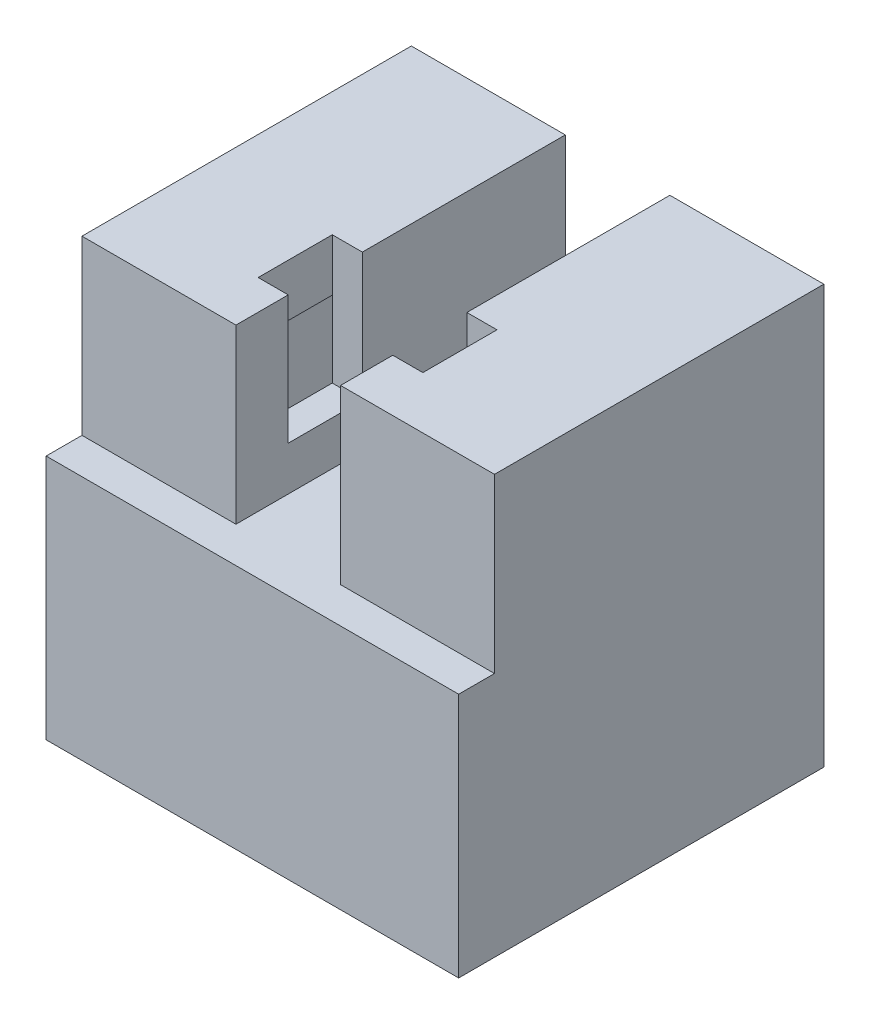
ISO-10303-21;
HEADER;
FILE_DESCRIPTION(('STEP AP214'),'2;1');
FILE_NAME('part.step','',(''),(''),'','','');
FILE_SCHEMA(('AUTOMOTIVE_DESIGN { 1 0 10303 214 1 1 1 1 }'));
ENDSEC;
DATA;
#1=APPLICATION_CONTEXT('core data for automotive mechanical design processes');
#2=APPLICATION_PROTOCOL_DEFINITION('international standard','automotive_design',2000,#1);
#3=PRODUCT_CONTEXT('',#1,'mechanical');
#4=PRODUCT('Part','Part','',(#3));
#5=PRODUCT_RELATED_PRODUCT_CATEGORY('part','',(#4));
#6=PRODUCT_DEFINITION_FORMATION('','',#4);
#7=PRODUCT_DEFINITION_CONTEXT('part definition',#1,'design');
#8=PRODUCT_DEFINITION('design','',#6,#7);
#9=PRODUCT_DEFINITION_SHAPE('','',#8);
#10=(LENGTH_UNIT() NAMED_UNIT(*) SI_UNIT(.MILLI.,.METRE.));
#11=(NAMED_UNIT(*) PLANE_ANGLE_UNIT() SI_UNIT($,.RADIAN.));
#12=(NAMED_UNIT(*) SI_UNIT($,.STERADIAN.) SOLID_ANGLE_UNIT());
#13=UNCERTAINTY_MEASURE_WITH_UNIT(LENGTH_MEASURE(1.E-05),#10,'distance_accuracy_value','');
#14=(GEOMETRIC_REPRESENTATION_CONTEXT(3) GLOBAL_UNCERTAINTY_ASSIGNED_CONTEXT((#13)) GLOBAL_UNIT_ASSIGNED_CONTEXT((#10,
#11,#12)) REPRESENTATION_CONTEXT('',''));
#15=CARTESIAN_POINT('',(0.,0.,0.));
#16=DIRECTION('',(0.,0.,1.));
#17=DIRECTION('',(1.,0.,0.));
#18=AXIS2_PLACEMENT_3D('',#15,#16,#17);
#19=CARTESIAN_POINT('',(-9.35,25.4,10.));
#20=DIRECTION('',(0.,0.,-1.));
#21=DIRECTION('',(-1.,0.,0.));
#22=AXIS2_PLACEMENT_3D('',#19,#20,#21);
#23=PLANE('',#22);
#24=DIRECTION('',(0.,-1.,0.));
#25=VECTOR('',#24,1.);
#26=CARTESIAN_POINT('',(-12.525,25.4,10.));
#27=LINE('',#26,#25);
#28=CARTESIAN_POINT('',(-12.525,25.4,10.));
#29=VERTEX_POINT('',#28);
#30=CARTESIAN_POINT('',(-12.525,14.925,10.));
#31=VERTEX_POINT('',#30);
#32=EDGE_CURVE('E409',#29,#31,#27,.T.);
#33=ORIENTED_EDGE('',*,*,#32,.T.);
#34=DIRECTION('',(1.,0.,0.));
#35=VECTOR('',#34,1.);
#36=CARTESIAN_POINT('',(-27.6076473140493,14.925,10.));
#37=LINE('',#36,#35);
#38=CARTESIAN_POINT('',(-3.175,14.925,10.));
#39=VERTEX_POINT('',#38);
#40=EDGE_CURVE('E44',#31,#39,#37,.T.);
#41=ORIENTED_EDGE('',*,*,#40,.T.);
#42=DIRECTION('',(0.,-1.,0.));
#43=VECTOR('',#42,1.);
#44=CARTESIAN_POINT('',(-3.175,0.,10.));
#45=LINE('',#44,#43);
#46=CARTESIAN_POINT('',(-3.175,25.4,10.));
#47=VERTEX_POINT('',#46);
#48=EDGE_CURVE('E432',#47,#39,#45,.T.);
#49=ORIENTED_EDGE('',*,*,#48,.F.);
#50=DIRECTION('',(1.,0.,0.));
#51=VECTOR('',#50,1.);
#52=CARTESIAN_POINT('',(-9.35,25.4,10.));
#53=LINE('',#52,#51);
#54=EDGE_CURVE('E459',#29,#47,#53,.T.);
#55=ORIENTED_EDGE('',*,*,#54,.F.);
#56=EDGE_LOOP('',(#33,#41,#49,#55));
#57=FACE_BOUND('',#56,.T.);
#58=ADVANCED_FACE('F33',(#57),#23,.F.);
#59=CARTESIAN_POINT('',(0.,0.,6.825));
#60=DIRECTION('',(0.,0.,-1.));
#61=DIRECTION('',(-1.,0.,0.));
#62=AXIS2_PLACEMENT_3D('',#59,#60,#61);
#63=PLANE('',#62);
#64=DIRECTION('',(1.,0.,0.));
#65=VECTOR('',#64,1.);
#66=CARTESIAN_POINT('',(0.,10.125,6.825));
#67=LINE('',#66,#65);
#68=CARTESIAN_POINT('',(-9.35,10.125,6.825));
#69=VERTEX_POINT('',#68);
#70=CARTESIAN_POINT('',(-5.,10.125,6.825));
#71=VERTEX_POINT('',#70);
#72=EDGE_CURVE('E42',#69,#71,#67,.T.);
#73=ORIENTED_EDGE('',*,*,#72,.F.);
#74=DIRECTION('',(0.,1.,0.));
#75=VECTOR('',#74,1.);
#76=CARTESIAN_POINT('',(-9.35,0.,6.825));
#77=LINE('',#76,#75);
#78=CARTESIAN_POINT('',(-9.35,22.225,6.825));
#79=VERTEX_POINT('',#78);
#80=EDGE_CURVE('E371',#69,#79,#77,.T.);
#81=ORIENTED_EDGE('',*,*,#80,.T.);
#82=DIRECTION('',(1.,0.,0.));
#83=VECTOR('',#82,1.);
#84=CARTESIAN_POINT('',(0.,22.225,6.825));
#85=LINE('',#84,#83);
#86=CARTESIAN_POINT('',(-5.,22.225,6.825));
#87=VERTEX_POINT('',#86);
#88=EDGE_CURVE('E373',#79,#87,#85,.T.);
#89=ORIENTED_EDGE('',*,*,#88,.T.);
#90=DIRECTION('',(0.,-1.,0.));
#91=VECTOR('',#90,1.);
#92=CARTESIAN_POINT('',(-5.,25.4,6.825));
#93=LINE('',#92,#91);
#94=CARTESIAN_POINT('',(-5.,25.4,6.825));
#95=VERTEX_POINT('',#94);
#96=EDGE_CURVE('E281',#95,#87,#93,.T.);
#97=ORIENTED_EDGE('',*,*,#96,.F.);
#98=DIRECTION('',(-1.,0.,0.));
#99=VECTOR('',#98,1.);
#100=CARTESIAN_POINT('',(-3.175,25.4,6.825));
#101=LINE('',#100,#99);
#102=CARTESIAN_POINT('',(-3.175,25.4,6.825));
#103=VERTEX_POINT('',#102);
#104=EDGE_CURVE('E51',#103,#95,#101,.T.);
#105=ORIENTED_EDGE('',*,*,#104,.F.);
#106=DIRECTION('',(0.,1.,0.));
#107=VECTOR('',#106,1.);
#108=CARTESIAN_POINT('',(-3.175,25.4,6.825));
#109=LINE('',#108,#107);
#110=CARTESIAN_POINT('',(-3.175,17.6,6.825));
#111=VERTEX_POINT('',#110);
#112=EDGE_CURVE('E266',#111,#103,#109,.T.);
#113=ORIENTED_EDGE('',*,*,#112,.F.);
#114=DIRECTION('',(1.,0.,0.));
#115=VECTOR('',#114,1.);
#116=CARTESIAN_POINT('',(-3.175,17.6,6.825));
#117=LINE('',#116,#115);
#118=CARTESIAN_POINT('',(-5.,17.6,6.825));
#119=VERTEX_POINT('',#118);
#120=EDGE_CURVE('E264',#119,#111,#117,.T.);
#121=ORIENTED_EDGE('',*,*,#120,.F.);
#122=DIRECTION('',(0.,1.,0.));
#123=VECTOR('',#122,1.);
#124=CARTESIAN_POINT('',(-5.,0.,6.825));
#125=LINE('',#124,#123);
#126=EDGE_CURVE('E359',#71,#119,#125,.T.);
#127=ORIENTED_EDGE('',*,*,#126,.F.);
#128=EDGE_LOOP('',(#73,#81,#89,#97,#105,#113,#121,#127));
#129=FACE_BOUND('',#128,.T.);
#130=ADVANCED_FACE('F518',(#129),#63,.T.);
#131=DIRECTION('',(0.,-1.,0.));
#132=VECTOR('',#131,1.);
#133=CARTESIAN_POINT('',(3.175,0.,10.));
#134=LINE('',#133,#132);
#135=CARTESIAN_POINT('',(3.175,25.4,10.));
#136=VERTEX_POINT('',#135);
#137=CARTESIAN_POINT('',(3.175,14.925,10.));
#138=VERTEX_POINT('',#137);
#139=EDGE_CURVE('E435',#136,#138,#134,.T.);
#140=ORIENTED_EDGE('',*,*,#139,.T.);
#141=CARTESIAN_POINT('',(12.525,14.925,10.));
#142=VERTEX_POINT('',#141);
#143=EDGE_CURVE('E11',#138,#142,#37,.T.);
#144=ORIENTED_EDGE('',*,*,#143,.T.);
#145=DIRECTION('',(0.,1.,0.));
#146=VECTOR('',#145,1.);
#147=CARTESIAN_POINT('',(12.525,25.4,10.));
#148=LINE('',#147,#146);
#149=CARTESIAN_POINT('',(12.525,25.4,10.));
#150=VERTEX_POINT('',#149);
#151=EDGE_CURVE('E421',#142,#150,#148,.T.);
#152=ORIENTED_EDGE('',*,*,#151,.T.);
#153=EDGE_CURVE('E463',#136,#150,#53,.T.);
#154=ORIENTED_EDGE('',*,*,#153,.F.);
#155=EDGE_LOOP('',(#140,#144,#152,#154));
#156=FACE_BOUND('',#155,.T.);
#157=ADVANCED_FACE('F35',(#156),#23,.F.);
#158=CARTESIAN_POINT('',(-9.35,25.4,-10.));
#159=DIRECTION('',(0.,0.,1.));
#160=DIRECTION('',(1.,0.,0.));
#161=AXIS2_PLACEMENT_3D('',#158,#159,#160);
#162=PLANE('',#161);
#163=DIRECTION('',(-1.,0.,0.));
#164=VECTOR('',#163,1.);
#165=CARTESIAN_POINT('',(-9.35,0.,-10.));
#166=LINE('',#165,#164);
#167=CARTESIAN_POINT('',(12.525,0.,-10.));
#168=VERTEX_POINT('',#167);
#169=CARTESIAN_POINT('',(11.,0.,-10.));
#170=VERTEX_POINT('',#169);
#171=EDGE_CURVE('E466',#168,#170,#166,.T.);
#172=ORIENTED_EDGE('',*,*,#171,.T.);
#173=DIRECTION('',(0.,-1.,0.));
#174=VECTOR('',#173,1.);
#175=CARTESIAN_POINT('',(11.,10.125,-10.));
#176=LINE('',#175,#174);
#177=CARTESIAN_POINT('',(11.,10.125,-10.));
#178=VERTEX_POINT('',#177);
#179=EDGE_CURVE('E322',#178,#170,#176,.T.);
#180=ORIENTED_EDGE('',*,*,#179,.F.);
#181=DIRECTION('',(1.,0.,0.));
#182=VECTOR('',#181,1.);
#183=CARTESIAN_POINT('',(11.,10.125,-10.));
#184=LINE('',#183,#182);
#185=CARTESIAN_POINT('',(9.35,10.125,-10.));
#186=VERTEX_POINT('',#185);
#187=EDGE_CURVE('E341',#186,#178,#184,.T.);
#188=ORIENTED_EDGE('',*,*,#187,.F.);
#189=DIRECTION('',(0.,-1.,0.));
#190=VECTOR('',#189,1.);
#191=CARTESIAN_POINT('',(9.35,0.,-10.));
#192=LINE('',#191,#190);
#193=CARTESIAN_POINT('',(9.35,22.225,-10.));
#194=VERTEX_POINT('',#193);
#195=EDGE_CURVE('E388',#194,#186,#192,.T.);
#196=ORIENTED_EDGE('',*,*,#195,.F.);
#197=DIRECTION('',(-1.,0.,0.));
#198=VECTOR('',#197,1.);
#199=CARTESIAN_POINT('',(0.,22.225,-10.));
#200=LINE('',#199,#198);
#201=CARTESIAN_POINT('',(5.,22.225,-10.));
#202=VERTEX_POINT('',#201);
#203=EDGE_CURVE('E385',#194,#202,#200,.T.);
#204=ORIENTED_EDGE('',*,*,#203,.T.);
#205=DIRECTION('',(0.,-1.,0.));
#206=VECTOR('',#205,1.);
#207=CARTESIAN_POINT('',(5.,0.,-10.));
#208=LINE('',#207,#206);
#209=CARTESIAN_POINT('',(5.,10.125,-10.));
#210=VERTEX_POINT('',#209);
#211=EDGE_CURVE('E382',#202,#210,#208,.T.);
#212=ORIENTED_EDGE('',*,*,#211,.T.);
#213=DIRECTION('',(-1.,0.,0.));
#214=VECTOR('',#213,1.);
#215=CARTESIAN_POINT('',(0.,10.125,-10.));
#216=LINE('',#215,#214);
#217=CARTESIAN_POINT('',(-5.,10.125,-10.));
#218=VERTEX_POINT('',#217);
#219=EDGE_CURVE('E379',#210,#218,#216,.T.);
#220=ORIENTED_EDGE('',*,*,#219,.T.);
#221=DIRECTION('',(0.,1.,0.));
#222=VECTOR('',#221,1.);
#223=CARTESIAN_POINT('',(-5.,0.,-10.));
#224=LINE('',#223,#222);
#225=CARTESIAN_POINT('',(-5.,22.225,-10.));
#226=VERTEX_POINT('',#225);
#227=EDGE_CURVE('E358',#218,#226,#224,.T.);
#228=ORIENTED_EDGE('',*,*,#227,.T.);
#229=DIRECTION('',(1.,0.,0.));
#230=VECTOR('',#229,1.);
#231=CARTESIAN_POINT('',(0.,22.225,-10.));
#232=LINE('',#231,#230);
#233=CARTESIAN_POINT('',(-9.35,22.225,-10.));
#234=VERTEX_POINT('',#233);
#235=EDGE_CURVE('E363',#234,#226,#232,.T.);
#236=ORIENTED_EDGE('',*,*,#235,.F.);
#237=DIRECTION('',(0.,1.,0.));
#238=VECTOR('',#237,1.);
#239=CARTESIAN_POINT('',(-9.35,0.,-10.));
#240=LINE('',#239,#238);
#241=CARTESIAN_POINT('',(-9.35,10.125,-10.));
#242=VERTEX_POINT('',#241);
#243=EDGE_CURVE('E391',#242,#234,#240,.T.);
#244=ORIENTED_EDGE('',*,*,#243,.F.);
#245=CARTESIAN_POINT('',(-11.,10.125,-10.));
#246=VERTEX_POINT('',#245);
#247=EDGE_CURVE('E327',#246,#242,#184,.T.);
#248=ORIENTED_EDGE('',*,*,#247,.F.);
#249=DIRECTION('',(0.,1.,0.));
#250=VECTOR('',#249,1.);
#251=CARTESIAN_POINT('',(-11.,10.125,-10.));
#252=LINE('',#251,#250);
#253=CARTESIAN_POINT('',(-11.,0.,-10.));
#254=VERTEX_POINT('',#253);
#255=EDGE_CURVE('E338',#254,#246,#252,.T.);
#256=ORIENTED_EDGE('',*,*,#255,.F.);
#257=CARTESIAN_POINT('',(-12.525,0.,-10.));
#258=VERTEX_POINT('',#257);
#259=EDGE_CURVE('E449',#254,#258,#166,.T.);
#260=ORIENTED_EDGE('',*,*,#259,.T.);
#261=DIRECTION('',(0.,1.,0.));
#262=VECTOR('',#261,1.);
#263=CARTESIAN_POINT('',(-12.525,25.4,-10.));
#264=LINE('',#263,#262);
#265=CARTESIAN_POINT('',(-12.525,25.4,-10.));
#266=VERTEX_POINT('',#265);
#267=EDGE_CURVE('E397',#258,#266,#264,.T.);
#268=ORIENTED_EDGE('',*,*,#267,.T.);
#269=DIRECTION('',(-1.,0.,0.));
#270=VECTOR('',#269,1.);
#271=CARTESIAN_POINT('',(-9.35,25.4,-10.));
#272=LINE('',#271,#270);
#273=CARTESIAN_POINT('',(-3.175,25.4,-10.));
#274=VERTEX_POINT('',#273);
#275=EDGE_CURVE('E462',#274,#266,#272,.T.);
#276=ORIENTED_EDGE('',*,*,#275,.F.);
#277=DIRECTION('',(0.,-1.,0.));
#278=VECTOR('',#277,1.);
#279=CARTESIAN_POINT('',(-3.175,0.,-10.));
#280=LINE('',#279,#278);
#281=CARTESIAN_POINT('',(-3.175,14.925,-10.));
#282=VERTEX_POINT('',#281);
#283=EDGE_CURVE('E423',#274,#282,#280,.T.);
#284=ORIENTED_EDGE('',*,*,#283,.T.);
#285=DIRECTION('',(-1.,0.,0.));
#286=VECTOR('',#285,1.);
#287=CARTESIAN_POINT('',(0.,14.925,-10.));
#288=LINE('',#287,#286);
#289=CARTESIAN_POINT('',(3.175,14.925,-10.));
#290=VERTEX_POINT('',#289);
#291=EDGE_CURVE('E436',#290,#282,#288,.T.);
#292=ORIENTED_EDGE('',*,*,#291,.F.);
#293=DIRECTION('',(0.,-1.,0.));
#294=VECTOR('',#293,1.);
#295=CARTESIAN_POINT('',(3.175,0.,-10.));
#296=LINE('',#295,#294);
#297=CARTESIAN_POINT('',(3.175,25.4,-10.));
#298=VERTEX_POINT('',#297);
#299=EDGE_CURVE('E442',#298,#290,#296,.T.);
#300=ORIENTED_EDGE('',*,*,#299,.F.);
#301=CARTESIAN_POINT('',(12.525,25.4,-10.));
#302=VERTEX_POINT('',#301);
#303=EDGE_CURVE('E464',#302,#298,#272,.T.);
#304=ORIENTED_EDGE('',*,*,#303,.F.);
#305=DIRECTION('',(0.,-1.,0.));
#306=VECTOR('',#305,1.);
#307=CARTESIAN_POINT('',(12.525,25.4,-10.));
#308=LINE('',#307,#306);
#309=EDGE_CURVE('E412',#302,#168,#308,.T.);
#310=ORIENTED_EDGE('',*,*,#309,.T.);
#311=EDGE_LOOP('',(#172,#180,#188,#196,#204,#212,#220,#228,#236,#244,#248,#256,#260,#268,#276,
#284,#292,#300,#304,#310));
#312=FACE_BOUND('',#311,.T.);
#313=ADVANCED_FACE('F473',(#312),#162,.F.);
#314=CARTESIAN_POINT('',(0.,25.4,0.));
#315=DIRECTION('',(0.,1.,0.));
#316=DIRECTION('',(0.,0.,1.));
#317=AXIS2_PLACEMENT_3D('',#314,#315,#316);
#318=PLANE('',#317);
#319=DIRECTION('',(1.,0.,0.));
#320=VECTOR('',#319,1.);
#321=CARTESIAN_POINT('',(-3.175,25.4,2.325));
#322=LINE('',#321,#320);
#323=CARTESIAN_POINT('',(-5.,25.4,2.325));
#324=VERTEX_POINT('',#323);
#325=CARTESIAN_POINT('',(-3.175,25.4,2.325));
#326=VERTEX_POINT('',#325);
#327=EDGE_CURVE('E296',#324,#326,#322,.T.);
#328=ORIENTED_EDGE('',*,*,#327,.T.);
#329=DIRECTION('',(0.,0.,-1.));
#330=VECTOR('',#329,1.);
#331=CARTESIAN_POINT('',(-3.175,25.4,10.));
#332=LINE('',#331,#330);
#333=EDGE_CURVE('E439',#326,#274,#332,.T.);
#334=ORIENTED_EDGE('',*,*,#333,.T.);
#335=ORIENTED_EDGE('',*,*,#275,.T.);
#336=DIRECTION('',(0.,0.,-1.));
#337=VECTOR('',#336,1.);
#338=CARTESIAN_POINT('',(-12.525,25.4,35.5976683508479));
#339=LINE('',#338,#337);
#340=EDGE_CURVE('E413',#29,#266,#339,.T.);
#341=ORIENTED_EDGE('',*,*,#340,.F.);
#342=ORIENTED_EDGE('',*,*,#54,.T.);
#343=EDGE_CURVE('E456',#47,#103,#332,.T.);
#344=ORIENTED_EDGE('',*,*,#343,.T.);
#345=ORIENTED_EDGE('',*,*,#104,.T.);
#346=DIRECTION('',(0.,0.,-1.));
#347=VECTOR('',#346,1.);
#348=CARTESIAN_POINT('',(-5.,25.4,14.8356569643195));
#349=LINE('',#348,#347);
#350=EDGE_CURVE('E283',#95,#324,#349,.T.);
#351=ORIENTED_EDGE('',*,*,#350,.T.);
#352=EDGE_LOOP('',(#328,#334,#335,#341,#342,#344,#345,#351));
#353=FACE_BOUND('',#352,.T.);
#354=ADVANCED_FACE('F487',(#353),#318,.T.);
#355=DIRECTION('',(1.,0.,0.));
#356=VECTOR('',#355,1.);
#357=CARTESIAN_POINT('',(5.,25.4,2.325));
#358=LINE('',#357,#356);
#359=CARTESIAN_POINT('',(3.175,25.4,2.325));
#360=VERTEX_POINT('',#359);
#361=CARTESIAN_POINT('',(5.,25.4,2.325));
#362=VERTEX_POINT('',#361);
#363=EDGE_CURVE('E248',#360,#362,#358,.T.);
#364=ORIENTED_EDGE('',*,*,#363,.T.);
#365=DIRECTION('',(0.,0.,-1.));
#366=VECTOR('',#365,1.);
#367=CARTESIAN_POINT('',(5.,25.4,14.8356569643195));
#368=LINE('',#367,#366);
#369=CARTESIAN_POINT('',(5.,25.4,6.825));
#370=VERTEX_POINT('',#369);
#371=EDGE_CURVE('E275',#370,#362,#368,.T.);
#372=ORIENTED_EDGE('',*,*,#371,.F.);
#373=DIRECTION('',(-1.,0.,0.));
#374=VECTOR('',#373,1.);
#375=CARTESIAN_POINT('',(5.,25.4,6.825));
#376=LINE('',#375,#374);
#377=CARTESIAN_POINT('',(3.175,25.4,6.825));
#378=VERTEX_POINT('',#377);
#379=EDGE_CURVE('E533',#370,#378,#376,.T.);
#380=ORIENTED_EDGE('',*,*,#379,.T.);
#381=DIRECTION('',(0.,0.,-1.));
#382=VECTOR('',#381,1.);
#383=CARTESIAN_POINT('',(3.175,25.4,10.));
#384=LINE('',#383,#382);
#385=EDGE_CURVE('E452',#136,#378,#384,.T.);
#386=ORIENTED_EDGE('',*,*,#385,.F.);
#387=ORIENTED_EDGE('',*,*,#153,.T.);
#388=DIRECTION('',(0.,0.,-1.));
#389=VECTOR('',#388,1.);
#390=CARTESIAN_POINT('',(12.525,25.4,35.5976683508479));
#391=LINE('',#390,#389);
#392=EDGE_CURVE('E427',#150,#302,#391,.T.);
#393=ORIENTED_EDGE('',*,*,#392,.T.);
#394=ORIENTED_EDGE('',*,*,#303,.T.);
#395=EDGE_CURVE('E455',#360,#298,#384,.T.);
#396=ORIENTED_EDGE('',*,*,#395,.F.);
#397=EDGE_LOOP('',(#364,#372,#380,#386,#387,#393,#394,#396));
#398=FACE_BOUND('',#397,.T.);
#399=ADVANCED_FACE('F504',(#398),#318,.T.);
#400=CARTESIAN_POINT('',(0.,0.,0.));
#401=DIRECTION('',(0.,1.,0.));
#402=DIRECTION('',(0.,0.,1.));
#403=AXIS2_PLACEMENT_3D('',#400,#401,#402);
#404=PLANE('',#403);
#405=DIRECTION('',(-1.,0.,0.));
#406=VECTOR('',#405,1.);
#407=CARTESIAN_POINT('',(11.,0.,9.));
#408=LINE('',#407,#406);
#409=CARTESIAN_POINT('',(11.,0.,9.));
#410=VERTEX_POINT('',#409);
#411=CARTESIAN_POINT('',(-11.,0.,9.));
#412=VERTEX_POINT('',#411);
#413=EDGE_CURVE('E326',#410,#412,#408,.T.);
#414=ORIENTED_EDGE('',*,*,#413,.F.);
#415=DIRECTION('',(0.,0.,-1.));
#416=VECTOR('',#415,1.);
#417=CARTESIAN_POINT('',(11.,0.,9.));
#418=LINE('',#417,#416);
#419=EDGE_CURVE('E336',#410,#170,#418,.T.);
#420=ORIENTED_EDGE('',*,*,#419,.T.);
#421=ORIENTED_EDGE('',*,*,#171,.F.);
#422=DIRECTION('',(0.,0.,-1.));
#423=VECTOR('',#422,1.);
#424=CARTESIAN_POINT('',(12.525,0.,35.5976683508479));
#425=LINE('',#424,#423);
#426=CARTESIAN_POINT('',(12.525,0.,12.175));
#427=VERTEX_POINT('',#426);
#428=EDGE_CURVE('E424',#427,#168,#425,.T.);
#429=ORIENTED_EDGE('',*,*,#428,.F.);
#430=DIRECTION('',(1.,0.,0.));
#431=VECTOR('',#430,1.);
#432=CARTESIAN_POINT('',(-27.6076473140494,0.,12.175));
#433=LINE('',#432,#431);
#434=CARTESIAN_POINT('',(-12.525,0.,12.175));
#435=VERTEX_POINT('',#434);
#436=EDGE_CURVE('E318',#435,#427,#433,.T.);
#437=ORIENTED_EDGE('',*,*,#436,.F.);
#438=DIRECTION('',(0.,0.,-1.));
#439=VECTOR('',#438,1.);
#440=CARTESIAN_POINT('',(-12.525,0.,35.5976683508479));
#441=LINE('',#440,#439);
#442=EDGE_CURVE('E416',#435,#258,#441,.T.);
#443=ORIENTED_EDGE('',*,*,#442,.T.);
#444=ORIENTED_EDGE('',*,*,#259,.F.);
#445=DIRECTION('',(0.,0.,-1.));
#446=VECTOR('',#445,1.);
#447=CARTESIAN_POINT('',(-11.,0.,9.));
#448=LINE('',#447,#446);
#449=EDGE_CURVE('E349',#412,#254,#448,.T.);
#450=ORIENTED_EDGE('',*,*,#449,.F.);
#451=EDGE_LOOP('',(#414,#420,#421,#429,#437,#443,#444,#450));
#452=FACE_BOUND('',#451,.T.);
#453=ADVANCED_FACE('F481',(#452),#404,.F.);
#454=CARTESIAN_POINT('',(-3.175,0.,10.));
#455=DIRECTION('',(1.,0.,0.));
#456=DIRECTION('',(0.,1.,0.));
#457=AXIS2_PLACEMENT_3D('',#454,#455,#456);
#458=PLANE('',#457);
#459=DIRECTION('',(0.,-1.,0.));
#460=VECTOR('',#459,1.);
#461=CARTESIAN_POINT('',(-3.175,25.4,2.325));
#462=LINE('',#461,#460);
#463=CARTESIAN_POINT('',(-3.175,17.6,2.325));
#464=VERTEX_POINT('',#463);
#465=EDGE_CURVE('E286',#326,#464,#462,.T.);
#466=ORIENTED_EDGE('',*,*,#465,.T.);
#467=DIRECTION('',(0.,0.,-1.));
#468=VECTOR('',#467,1.);
#469=CARTESIAN_POINT('',(-3.175,17.6,14.8356569643195));
#470=LINE('',#469,#468);
#471=EDGE_CURVE('E299',#111,#464,#470,.T.);
#472=ORIENTED_EDGE('',*,*,#471,.F.);
#473=ORIENTED_EDGE('',*,*,#112,.T.);
#474=ORIENTED_EDGE('',*,*,#343,.F.);
#475=ORIENTED_EDGE('',*,*,#48,.T.);
#476=DIRECTION('',(0.,0.,-1.));
#477=VECTOR('',#476,1.);
#478=CARTESIAN_POINT('',(-3.175,14.925,10.));
#479=LINE('',#478,#477);
#480=EDGE_CURVE('E447',#39,#282,#479,.T.);
#481=ORIENTED_EDGE('',*,*,#480,.T.);
#482=ORIENTED_EDGE('',*,*,#283,.F.);
#483=ORIENTED_EDGE('',*,*,#333,.F.);
#484=EDGE_LOOP('',(#466,#472,#473,#474,#475,#481,#482,#483));
#485=FACE_BOUND('',#484,.T.);
#486=ADVANCED_FACE('F493',(#485),#458,.T.);
#487=CARTESIAN_POINT('',(0.,14.925,10.));
#488=DIRECTION('',(0.,-1.,0.));
#489=DIRECTION('',(0.,0.,-1.));
#490=AXIS2_PLACEMENT_3D('',#487,#488,#489);
#491=PLANE('',#490);
#492=ORIENTED_EDGE('',*,*,#291,.T.);
#493=ORIENTED_EDGE('',*,*,#480,.F.);
#494=ORIENTED_EDGE('',*,*,#40,.F.);
#495=DIRECTION('',(0.,0.,1.));
#496=VECTOR('',#495,1.);
#497=CARTESIAN_POINT('',(-12.525,14.925,10.));
#498=LINE('',#497,#496);
#499=CARTESIAN_POINT('',(-12.525,14.925,12.175));
#500=VERTEX_POINT('',#499);
#501=EDGE_CURVE('E309',#31,#500,#498,.T.);
#502=ORIENTED_EDGE('',*,*,#501,.T.);
#503=DIRECTION('',(1.,0.,0.));
#504=VECTOR('',#503,1.);
#505=CARTESIAN_POINT('',(-27.6076473140493,14.925,12.175));
#506=LINE('',#505,#504);
#507=CARTESIAN_POINT('',(12.525,14.925,12.175));
#508=VERTEX_POINT('',#507);
#509=EDGE_CURVE('E314',#500,#508,#506,.T.);
#510=ORIENTED_EDGE('',*,*,#509,.T.);
#511=DIRECTION('',(0.,0.,1.));
#512=VECTOR('',#511,1.);
#513=CARTESIAN_POINT('',(12.525,14.925,10.));
#514=LINE('',#513,#512);
#515=EDGE_CURVE('E280',#142,#508,#514,.T.);
#516=ORIENTED_EDGE('',*,*,#515,.F.);
#517=ORIENTED_EDGE('',*,*,#143,.F.);
#518=DIRECTION('',(0.,0.,-1.));
#519=VECTOR('',#518,1.);
#520=CARTESIAN_POINT('',(3.175,14.925,10.));
#521=LINE('',#520,#519);
#522=EDGE_CURVE('E450',#138,#290,#521,.T.);
#523=ORIENTED_EDGE('',*,*,#522,.T.);
#524=EDGE_LOOP('',(#492,#493,#494,#502,#510,#516,#517,#523));
#525=FACE_BOUND('',#524,.T.);
#526=ADVANCED_FACE('F498',(#525),#491,.F.);
#527=CARTESIAN_POINT('',(3.175,0.,10.));
#528=DIRECTION('',(1.,0.,0.));
#529=DIRECTION('',(0.,1.,0.));
#530=AXIS2_PLACEMENT_3D('',#527,#528,#529);
#531=PLANE('',#530);
#532=DIRECTION('',(0.,0.,-1.));
#533=VECTOR('',#532,1.);
#534=CARTESIAN_POINT('',(3.175,17.6,14.8356569643195));
#535=LINE('',#534,#533);
#536=CARTESIAN_POINT('',(3.175,17.6,6.825));
#537=VERTEX_POINT('',#536);
#538=CARTESIAN_POINT('',(3.175,17.6,2.325));
#539=VERTEX_POINT('',#538);
#540=EDGE_CURVE('E247',#537,#539,#535,.T.);
#541=ORIENTED_EDGE('',*,*,#540,.T.);
#542=DIRECTION('',(0.,1.,0.));
#543=VECTOR('',#542,1.);
#544=CARTESIAN_POINT('',(3.175,25.4,2.325));
#545=LINE('',#544,#543);
#546=EDGE_CURVE('E256',#539,#360,#545,.T.);
#547=ORIENTED_EDGE('',*,*,#546,.T.);
#548=ORIENTED_EDGE('',*,*,#395,.T.);
#549=ORIENTED_EDGE('',*,*,#299,.T.);
#550=ORIENTED_EDGE('',*,*,#522,.F.);
#551=ORIENTED_EDGE('',*,*,#139,.F.);
#552=ORIENTED_EDGE('',*,*,#385,.T.);
#553=DIRECTION('',(0.,-1.,0.));
#554=VECTOR('',#553,1.);
#555=CARTESIAN_POINT('',(3.175,25.4,6.825));
#556=LINE('',#555,#554);
#557=EDGE_CURVE('E277',#378,#537,#556,.T.);
#558=ORIENTED_EDGE('',*,*,#557,.T.);
#559=EDGE_LOOP('',(#541,#547,#548,#549,#550,#551,#552,#558));
#560=FACE_BOUND('',#559,.T.);
#561=ADVANCED_FACE('F501',(#560),#531,.F.);
#562=CARTESIAN_POINT('',(12.525,25.4,35.5976683508479));
#563=DIRECTION('',(1.,0.,0.));
#564=DIRECTION('',(0.,1.,0.));
#565=AXIS2_PLACEMENT_3D('',#562,#563,#564);
#566=PLANE('',#565);
#567=ORIENTED_EDGE('',*,*,#151,.F.);
#568=ORIENTED_EDGE('',*,*,#515,.T.);
#569=DIRECTION('',(0.,-1.,0.));
#570=VECTOR('',#569,1.);
#571=CARTESIAN_POINT('',(12.525,14.925,12.175));
#572=LINE('',#571,#570);
#573=EDGE_CURVE('E306',#508,#427,#572,.T.);
#574=ORIENTED_EDGE('',*,*,#573,.T.);
#575=ORIENTED_EDGE('',*,*,#428,.T.);
#576=ORIENTED_EDGE('',*,*,#309,.F.);
#577=ORIENTED_EDGE('',*,*,#392,.F.);
#578=EDGE_LOOP('',(#567,#568,#574,#575,#576,#577));
#579=FACE_BOUND('',#578,.T.);
#580=ADVANCED_FACE('F511',(#579),#566,.T.);
#581=CARTESIAN_POINT('',(-12.525,25.4,35.5976683508479));
#582=DIRECTION('',(-1.,0.,0.));
#583=DIRECTION('',(0.,-1.,0.));
#584=AXIS2_PLACEMENT_3D('',#581,#582,#583);
#585=PLANE('',#584);
#586=ORIENTED_EDGE('',*,*,#32,.F.);
#587=ORIENTED_EDGE('',*,*,#340,.T.);
#588=ORIENTED_EDGE('',*,*,#267,.F.);
#589=ORIENTED_EDGE('',*,*,#442,.F.);
#590=DIRECTION('',(0.,-1.,0.));
#591=VECTOR('',#590,1.);
#592=CARTESIAN_POINT('',(-12.525,14.925,12.175));
#593=LINE('',#592,#591);
#594=EDGE_CURVE('E315',#500,#435,#593,.T.);
#595=ORIENTED_EDGE('',*,*,#594,.F.);
#596=ORIENTED_EDGE('',*,*,#501,.F.);
#597=EDGE_LOOP('',(#586,#587,#588,#589,#595,#596));
#598=FACE_BOUND('',#597,.T.);
#599=ADVANCED_FACE('F484',(#598),#585,.T.);
#600=CARTESIAN_POINT('',(-5.,0.,6.825));
#601=DIRECTION('',(-1.,0.,0.));
#602=DIRECTION('',(0.,-1.,0.));
#603=AXIS2_PLACEMENT_3D('',#600,#601,#602);
#604=PLANE('',#603);
#605=DIRECTION('',(0.,0.,-1.));
#606=VECTOR('',#605,1.);
#607=CARTESIAN_POINT('',(-5.,17.6,14.8356569643195));
#608=LINE('',#607,#606);
#609=CARTESIAN_POINT('',(-5.,17.6,2.325));
#610=VERTEX_POINT('',#609);
#611=EDGE_CURVE('E302',#119,#610,#608,.T.);
#612=ORIENTED_EDGE('',*,*,#611,.T.);
#613=DIRECTION('',(0.,1.,0.));
#614=VECTOR('',#613,1.);
#615=CARTESIAN_POINT('',(-5.,25.4,2.325));
#616=LINE('',#615,#614);
#617=CARTESIAN_POINT('',(-5.,22.225,2.325));
#618=VERTEX_POINT('',#617);
#619=EDGE_CURVE('E293',#610,#618,#616,.T.);
#620=ORIENTED_EDGE('',*,*,#619,.T.);
#621=DIRECTION('',(0.,0.,-1.));
#622=VECTOR('',#621,1.);
#623=CARTESIAN_POINT('',(-5.,22.225,6.825));
#624=LINE('',#623,#622);
#625=EDGE_CURVE('E398',#618,#226,#624,.T.);
#626=ORIENTED_EDGE('',*,*,#625,.T.);
#627=ORIENTED_EDGE('',*,*,#227,.F.);
#628=DIRECTION('',(0.,0.,-1.));
#629=VECTOR('',#628,1.);
#630=CARTESIAN_POINT('',(-5.,10.125,6.825));
#631=LINE('',#630,#629);
#632=EDGE_CURVE('E376',#71,#218,#631,.T.);
#633=ORIENTED_EDGE('',*,*,#632,.F.);
#634=ORIENTED_EDGE('',*,*,#126,.T.);
#635=EDGE_LOOP('',(#612,#620,#626,#627,#633,#634));
#636=FACE_BOUND('',#635,.T.);
#637=ADVANCED_FACE('F556',(#636),#604,.T.);
#638=CARTESIAN_POINT('',(0.,22.225,6.825));
#639=DIRECTION('',(0.,1.,0.));
#640=DIRECTION('',(0.,0.,1.));
#641=AXIS2_PLACEMENT_3D('',#638,#639,#640);
#642=PLANE('',#641);
#643=ORIENTED_EDGE('',*,*,#235,.T.);
#644=ORIENTED_EDGE('',*,*,#625,.F.);
#645=EDGE_CURVE('E395',#87,#618,#624,.T.);
#646=ORIENTED_EDGE('',*,*,#645,.F.);
#647=ORIENTED_EDGE('',*,*,#88,.F.);
#648=DIRECTION('',(0.,0.,-1.));
#649=VECTOR('',#648,1.);
#650=CARTESIAN_POINT('',(-9.35,22.225,6.825));
#651=LINE('',#650,#649);
#652=EDGE_CURVE('E399',#79,#234,#651,.T.);
#653=ORIENTED_EDGE('',*,*,#652,.T.);
#654=EDGE_LOOP('',(#643,#644,#646,#647,#653));
#655=FACE_BOUND('',#654,.T.);
#656=ADVANCED_FACE('F552',(#655),#642,.F.);
#657=CARTESIAN_POINT('',(-9.35,0.,6.825));
#658=DIRECTION('',(-1.,0.,0.));
#659=DIRECTION('',(0.,-1.,0.));
#660=AXIS2_PLACEMENT_3D('',#657,#658,#659);
#661=PLANE('',#660);
#662=ORIENTED_EDGE('',*,*,#80,.F.);
#663=DIRECTION('',(0.,0.,-1.));
#664=VECTOR('',#663,1.);
#665=CARTESIAN_POINT('',(-9.35,10.125,6.825));
#666=LINE('',#665,#664);
#667=EDGE_CURVE('E355',#69,#242,#666,.T.);
#668=ORIENTED_EDGE('',*,*,#667,.T.);
#669=ORIENTED_EDGE('',*,*,#243,.T.);
#670=ORIENTED_EDGE('',*,*,#652,.F.);
#671=EDGE_LOOP('',(#662,#668,#669,#670));
#672=FACE_BOUND('',#671,.T.);
#673=ADVANCED_FACE('F555',(#672),#661,.F.);
#674=CARTESIAN_POINT('',(9.35,0.,6.825));
#675=DIRECTION('',(1.,0.,0.));
#676=DIRECTION('',(0.,0.,-1.));
#677=AXIS2_PLACEMENT_3D('',#674,#675,#676);
#678=PLANE('',#677);
#679=ORIENTED_EDGE('',*,*,#195,.T.);
#680=DIRECTION('',(0.,0.,1.));
#681=VECTOR('',#680,1.);
#682=CARTESIAN_POINT('',(9.35,10.125,6.825));
#683=LINE('',#682,#681);
#684=CARTESIAN_POINT('',(9.35,10.125,6.825));
#685=VERTEX_POINT('',#684);
#686=EDGE_CURVE('E346',#186,#685,#683,.T.);
#687=ORIENTED_EDGE('',*,*,#686,.T.);
#688=DIRECTION('',(0.,-1.,0.));
#689=VECTOR('',#688,1.);
#690=CARTESIAN_POINT('',(9.35,0.,6.825));
#691=LINE('',#690,#689);
#692=CARTESIAN_POINT('',(9.35,22.225,6.825));
#693=VERTEX_POINT('',#692);
#694=EDGE_CURVE('E368',#693,#685,#691,.T.);
#695=ORIENTED_EDGE('',*,*,#694,.F.);
#696=DIRECTION('',(0.,0.,-1.));
#697=VECTOR('',#696,1.);
#698=CARTESIAN_POINT('',(9.35,22.225,6.825));
#699=LINE('',#698,#697);
#700=EDGE_CURVE('E402',#693,#194,#699,.T.);
#701=ORIENTED_EDGE('',*,*,#700,.T.);
#702=EDGE_LOOP('',(#679,#687,#695,#701));
#703=FACE_BOUND('',#702,.T.);
#704=ADVANCED_FACE('F560',(#703),#678,.F.);
#705=CARTESIAN_POINT('',(0.,22.225,6.825));
#706=DIRECTION('',(0.,-1.,0.));
#707=DIRECTION('',(0.,0.,-1.));
#708=AXIS2_PLACEMENT_3D('',#705,#706,#707);
#709=PLANE('',#708);
#710=ORIENTED_EDGE('',*,*,#203,.F.);
#711=ORIENTED_EDGE('',*,*,#700,.F.);
#712=DIRECTION('',(-1.,0.,0.));
#713=VECTOR('',#712,1.);
#714=CARTESIAN_POINT('',(0.,22.225,6.825));
#715=LINE('',#714,#713);
#716=CARTESIAN_POINT('',(5.,22.225,6.825));
#717=VERTEX_POINT('',#716);
#718=EDGE_CURVE('E365',#693,#717,#715,.T.);
#719=ORIENTED_EDGE('',*,*,#718,.T.);
#720=DIRECTION('',(0.,0.,-1.));
#721=VECTOR('',#720,1.);
#722=CARTESIAN_POINT('',(5.,22.225,6.825));
#723=LINE('',#722,#721);
#724=CARTESIAN_POINT('',(5.,22.225,2.325));
#725=VERTEX_POINT('',#724);
#726=EDGE_CURVE('E404',#717,#725,#723,.T.);
#727=ORIENTED_EDGE('',*,*,#726,.T.);
#728=EDGE_CURVE('E262',#725,#202,#723,.T.);
#729=ORIENTED_EDGE('',*,*,#728,.T.);
#730=EDGE_LOOP('',(#710,#711,#719,#727,#729));
#731=FACE_BOUND('',#730,.T.);
#732=ADVANCED_FACE('F564',(#731),#709,.T.);
#733=CARTESIAN_POINT('',(5.,0.,6.825));
#734=DIRECTION('',(1.,0.,0.));
#735=DIRECTION('',(0.,1.,0.));
#736=AXIS2_PLACEMENT_3D('',#733,#734,#735);
#737=PLANE('',#736);
#738=DIRECTION('',(0.,0.,-1.));
#739=VECTOR('',#738,1.);
#740=CARTESIAN_POINT('',(5.,17.6,14.8356569643195));
#741=LINE('',#740,#739);
#742=CARTESIAN_POINT('',(5.,17.6,6.825));
#743=VERTEX_POINT('',#742);
#744=CARTESIAN_POINT('',(5.,17.6,2.325));
#745=VERTEX_POINT('',#744);
#746=EDGE_CURVE('E240',#743,#745,#741,.T.);
#747=ORIENTED_EDGE('',*,*,#746,.F.);
#748=DIRECTION('',(0.,-1.,0.));
#749=VECTOR('',#748,1.);
#750=CARTESIAN_POINT('',(5.,0.,6.825));
#751=LINE('',#750,#749);
#752=CARTESIAN_POINT('',(5.,10.125,6.825));
#753=VERTEX_POINT('',#752);
#754=EDGE_CURVE('E362',#743,#753,#751,.T.);
#755=ORIENTED_EDGE('',*,*,#754,.T.);
#756=DIRECTION('',(0.,0.,-1.));
#757=VECTOR('',#756,1.);
#758=CARTESIAN_POINT('',(5.,10.125,6.825));
#759=LINE('',#758,#757);
#760=EDGE_CURVE('E406',#753,#210,#759,.T.);
#761=ORIENTED_EDGE('',*,*,#760,.T.);
#762=ORIENTED_EDGE('',*,*,#211,.F.);
#763=ORIENTED_EDGE('',*,*,#728,.F.);
#764=DIRECTION('',(0.,-1.,0.));
#765=VECTOR('',#764,1.);
#766=CARTESIAN_POINT('',(5.,25.4,2.325));
#767=LINE('',#766,#765);
#768=EDGE_CURVE('E253',#725,#745,#767,.T.);
#769=ORIENTED_EDGE('',*,*,#768,.T.);
#770=EDGE_LOOP('',(#747,#755,#761,#762,#763,#769));
#771=FACE_BOUND('',#770,.T.);
#772=ADVANCED_FACE('F260',(#771),#737,.T.);
#773=CARTESIAN_POINT('',(0.,10.125,6.825));
#774=DIRECTION('',(0.,-1.,0.));
#775=DIRECTION('',(0.,0.,-1.));
#776=AXIS2_PLACEMENT_3D('',#773,#774,#775);
#777=PLANE('',#776);
#778=ORIENTED_EDGE('',*,*,#219,.F.);
#779=ORIENTED_EDGE('',*,*,#760,.F.);
#780=EDGE_CURVE('E37',#753,#685,#67,.T.);
#781=ORIENTED_EDGE('',*,*,#780,.T.);
#782=ORIENTED_EDGE('',*,*,#686,.F.);
#783=ORIENTED_EDGE('',*,*,#187,.T.);
#784=DIRECTION('',(0.,0.,-1.));
#785=VECTOR('',#784,1.);
#786=CARTESIAN_POINT('',(11.,10.125,9.));
#787=LINE('',#786,#785);
#788=CARTESIAN_POINT('',(11.,10.125,9.));
#789=VERTEX_POINT('',#788);
#790=EDGE_CURVE('E343',#789,#178,#787,.T.);
#791=ORIENTED_EDGE('',*,*,#790,.F.);
#792=DIRECTION('',(1.,0.,0.));
#793=VECTOR('',#792,1.);
#794=CARTESIAN_POINT('',(11.,10.125,9.));
#795=LINE('',#794,#793);
#796=CARTESIAN_POINT('',(-11.,10.125,9.));
#797=VERTEX_POINT('',#796);
#798=EDGE_CURVE('E333',#797,#789,#795,.T.);
#799=ORIENTED_EDGE('',*,*,#798,.F.);
#800=DIRECTION('',(0.,0.,-1.));
#801=VECTOR('',#800,1.);
#802=CARTESIAN_POINT('',(-11.,10.125,9.));
#803=LINE('',#802,#801);
#804=EDGE_CURVE('E347',#797,#246,#803,.T.);
#805=ORIENTED_EDGE('',*,*,#804,.T.);
#806=ORIENTED_EDGE('',*,*,#247,.T.);
#807=ORIENTED_EDGE('',*,*,#667,.F.);
#808=ORIENTED_EDGE('',*,*,#72,.T.);
#809=ORIENTED_EDGE('',*,*,#632,.T.);
#810=EDGE_LOOP('',(#778,#779,#781,#782,#783,#791,#799,#805,#806,#807,#808,#809));
#811=FACE_BOUND('',#810,.T.);
#812=ADVANCED_FACE('F539',(#811),#777,.T.);
#813=ORIENTED_EDGE('',*,*,#780,.F.);
#814=ORIENTED_EDGE('',*,*,#754,.F.);
#815=DIRECTION('',(1.,0.,0.));
#816=VECTOR('',#815,1.);
#817=CARTESIAN_POINT('',(5.,17.6,6.825));
#818=LINE('',#817,#816);
#819=EDGE_CURVE('E59',#537,#743,#818,.T.);
#820=ORIENTED_EDGE('',*,*,#819,.F.);
#821=ORIENTED_EDGE('',*,*,#557,.F.);
#822=ORIENTED_EDGE('',*,*,#379,.F.);
#823=DIRECTION('',(0.,1.,0.));
#824=VECTOR('',#823,1.);
#825=CARTESIAN_POINT('',(5.,25.4,6.825));
#826=LINE('',#825,#824);
#827=EDGE_CURVE('E269',#717,#370,#826,.T.);
#828=ORIENTED_EDGE('',*,*,#827,.F.);
#829=ORIENTED_EDGE('',*,*,#718,.F.);
#830=ORIENTED_EDGE('',*,*,#694,.T.);
#831=EDGE_LOOP('',(#813,#814,#820,#821,#822,#828,#829,#830));
#832=FACE_BOUND('',#831,.T.);
#833=ADVANCED_FACE('F524',(#832),#63,.T.);
#834=CARTESIAN_POINT('',(11.,10.125,9.));
#835=DIRECTION('',(1.,0.,0.));
#836=DIRECTION('',(0.,0.,-1.));
#837=AXIS2_PLACEMENT_3D('',#834,#835,#836);
#838=PLANE('',#837);
#839=ORIENTED_EDGE('',*,*,#179,.T.);
#840=ORIENTED_EDGE('',*,*,#419,.F.);
#841=DIRECTION('',(0.,-1.,0.));
#842=VECTOR('',#841,1.);
#843=CARTESIAN_POINT('',(11.,10.125,9.));
#844=LINE('',#843,#842);
#845=EDGE_CURVE('E323',#789,#410,#844,.T.);
#846=ORIENTED_EDGE('',*,*,#845,.F.);
#847=ORIENTED_EDGE('',*,*,#790,.T.);
#848=EDGE_LOOP('',(#839,#840,#846,#847));
#849=FACE_BOUND('',#848,.T.);
#850=ADVANCED_FACE('F538',(#849),#838,.F.);
#851=CARTESIAN_POINT('',(-11.,10.125,9.));
#852=DIRECTION('',(-1.,0.,0.));
#853=DIRECTION('',(0.,-1.,0.));
#854=AXIS2_PLACEMENT_3D('',#851,#852,#853);
#855=PLANE('',#854);
#856=ORIENTED_EDGE('',*,*,#255,.T.);
#857=ORIENTED_EDGE('',*,*,#804,.F.);
#858=DIRECTION('',(0.,1.,0.));
#859=VECTOR('',#858,1.);
#860=CARTESIAN_POINT('',(-11.,10.125,9.));
#861=LINE('',#860,#859);
#862=EDGE_CURVE('E330',#412,#797,#861,.T.);
#863=ORIENTED_EDGE('',*,*,#862,.F.);
#864=ORIENTED_EDGE('',*,*,#449,.T.);
#865=EDGE_LOOP('',(#856,#857,#863,#864));
#866=FACE_BOUND('',#865,.T.);
#867=ADVANCED_FACE('F544',(#866),#855,.F.);
#868=CARTESIAN_POINT('',(0.,0.,9.));
#869=DIRECTION('',(0.,0.,-1.));
#870=DIRECTION('',(-1.,0.,0.));
#871=AXIS2_PLACEMENT_3D('',#868,#869,#870);
#872=PLANE('',#871);
#873=ORIENTED_EDGE('',*,*,#845,.T.);
#874=ORIENTED_EDGE('',*,*,#413,.T.);
#875=ORIENTED_EDGE('',*,*,#862,.T.);
#876=ORIENTED_EDGE('',*,*,#798,.T.);
#877=EDGE_LOOP('',(#873,#874,#875,#876));
#878=FACE_BOUND('',#877,.T.);
#879=ADVANCED_FACE('F672',(#878),#872,.T.);
#880=CARTESIAN_POINT('',(-27.6076473140493,14.925,12.175));
#881=DIRECTION('',(0.,0.,1.));
#882=DIRECTION('',(0.,-1.,0.));
#883=AXIS2_PLACEMENT_3D('',#880,#881,#882);
#884=PLANE('',#883);
#885=ORIENTED_EDGE('',*,*,#509,.F.);
#886=ORIENTED_EDGE('',*,*,#594,.T.);
#887=ORIENTED_EDGE('',*,*,#436,.T.);
#888=ORIENTED_EDGE('',*,*,#573,.F.);
#889=EDGE_LOOP('',(#885,#886,#887,#888));
#890=FACE_BOUND('',#889,.T.);
#891=ADVANCED_FACE('F515',(#890),#884,.T.);
#892=CARTESIAN_POINT('',(5.,25.4,14.8356569643195));
#893=DIRECTION('',(1.,0.,0.));
#894=DIRECTION('',(0.,1.,0.));
#895=AXIS2_PLACEMENT_3D('',#892,#893,#894);
#896=PLANE('',#895);
#897=ORIENTED_EDGE('',*,*,#726,.F.);
#898=ORIENTED_EDGE('',*,*,#827,.T.);
#899=ORIENTED_EDGE('',*,*,#371,.T.);
#900=EDGE_CURVE('E257',#362,#725,#767,.T.);
#901=ORIENTED_EDGE('',*,*,#900,.T.);
#902=EDGE_LOOP('',(#897,#898,#899,#901));
#903=FACE_BOUND('',#902,.T.);
#904=ADVANCED_FACE('F684',(#903),#896,.F.);
#905=CARTESIAN_POINT('',(5.,17.6,14.8356569643195));
#906=DIRECTION('',(0.,-1.,0.));
#907=DIRECTION('',(0.,0.,-1.));
#908=AXIS2_PLACEMENT_3D('',#905,#906,#907);
#909=PLANE('',#908);
#910=ORIENTED_EDGE('',*,*,#819,.T.);
#911=ORIENTED_EDGE('',*,*,#746,.T.);
#912=DIRECTION('',(-1.,0.,0.));
#913=VECTOR('',#912,1.);
#914=CARTESIAN_POINT('',(5.,17.6,2.325));
#915=LINE('',#914,#913);
#916=EDGE_CURVE('E243',#745,#539,#915,.T.);
#917=ORIENTED_EDGE('',*,*,#916,.T.);
#918=ORIENTED_EDGE('',*,*,#540,.F.);
#919=EDGE_LOOP('',(#910,#911,#917,#918));
#920=FACE_BOUND('',#919,.T.);
#921=ADVANCED_FACE('F242',(#920),#909,.F.);
#922=CARTESIAN_POINT('',(0.,0.,2.325));
#923=DIRECTION('',(0.,0.,-1.));
#924=DIRECTION('',(-1.,0.,0.));
#925=AXIS2_PLACEMENT_3D('',#922,#923,#924);
#926=PLANE('',#925);
#927=ORIENTED_EDGE('',*,*,#900,.F.);
#928=ORIENTED_EDGE('',*,*,#363,.F.);
#929=ORIENTED_EDGE('',*,*,#546,.F.);
#930=ORIENTED_EDGE('',*,*,#916,.F.);
#931=ORIENTED_EDGE('',*,*,#768,.F.);
#932=EDGE_LOOP('',(#927,#928,#929,#930,#931));
#933=FACE_BOUND('',#932,.T.);
#934=ADVANCED_FACE('F252',(#933),#926,.F.);
#935=CARTESIAN_POINT('',(-5.,25.4,14.8356569643195));
#936=DIRECTION('',(-1.,0.,0.));
#937=DIRECTION('',(0.,0.,1.));
#938=AXIS2_PLACEMENT_3D('',#935,#936,#937);
#939=PLANE('',#938);
#940=EDGE_CURVE('E292',#618,#324,#616,.T.);
#941=ORIENTED_EDGE('',*,*,#940,.T.);
#942=ORIENTED_EDGE('',*,*,#350,.F.);
#943=ORIENTED_EDGE('',*,*,#96,.T.);
#944=ORIENTED_EDGE('',*,*,#645,.T.);
#945=EDGE_LOOP('',(#941,#942,#943,#944));
#946=FACE_BOUND('',#945,.T.);
#947=ADVANCED_FACE('F822',(#946),#939,.F.);
#948=CARTESIAN_POINT('',(-3.175,17.6,14.8356569643195));
#949=DIRECTION('',(0.,-1.,0.));
#950=DIRECTION('',(0.,0.,-1.));
#951=AXIS2_PLACEMENT_3D('',#948,#949,#950);
#952=PLANE('',#951);
#953=ORIENTED_EDGE('',*,*,#120,.T.);
#954=ORIENTED_EDGE('',*,*,#471,.T.);
#955=DIRECTION('',(-1.,0.,0.));
#956=VECTOR('',#955,1.);
#957=CARTESIAN_POINT('',(-3.175,17.6,2.325));
#958=LINE('',#957,#956);
#959=EDGE_CURVE('E289',#464,#610,#958,.T.);
#960=ORIENTED_EDGE('',*,*,#959,.T.);
#961=ORIENTED_EDGE('',*,*,#611,.F.);
#962=EDGE_LOOP('',(#953,#954,#960,#961));
#963=FACE_BOUND('',#962,.T.);
#964=ADVANCED_FACE('F830',(#963),#952,.F.);
#965=CARTESIAN_POINT('',(0.,0.,2.325));
#966=DIRECTION('',(0.,0.,-1.));
#967=DIRECTION('',(-1.,0.,0.));
#968=AXIS2_PLACEMENT_3D('',#965,#966,#967);
#969=PLANE('',#968);
#970=ORIENTED_EDGE('',*,*,#465,.F.);
#971=ORIENTED_EDGE('',*,*,#327,.F.);
#972=ORIENTED_EDGE('',*,*,#940,.F.);
#973=ORIENTED_EDGE('',*,*,#619,.F.);
#974=ORIENTED_EDGE('',*,*,#959,.F.);
#975=EDGE_LOOP('',(#970,#971,#972,#973,#974));
#976=FACE_BOUND('',#975,.T.);
#977=ADVANCED_FACE('F839',(#976),#969,.F.);
#978=CLOSED_SHELL('',(#58,#130,#157,#313,#354,#399,#453,#486,#526,#561,#580,#599,#637,#656,#673,
#704,#732,#772,#812,#833,#850,#867,#879,#891,#904,#921,#934,#947,#964,#977));
#979=MANIFOLD_SOLID_BREP('B2',#978);
#980=ADVANCED_BREP_SHAPE_REPRESENTATION('',(#18,#979),#14);
#981=SHAPE_DEFINITION_REPRESENTATION(#9,#980);
ENDSEC;
END-ISO-10303-21;
